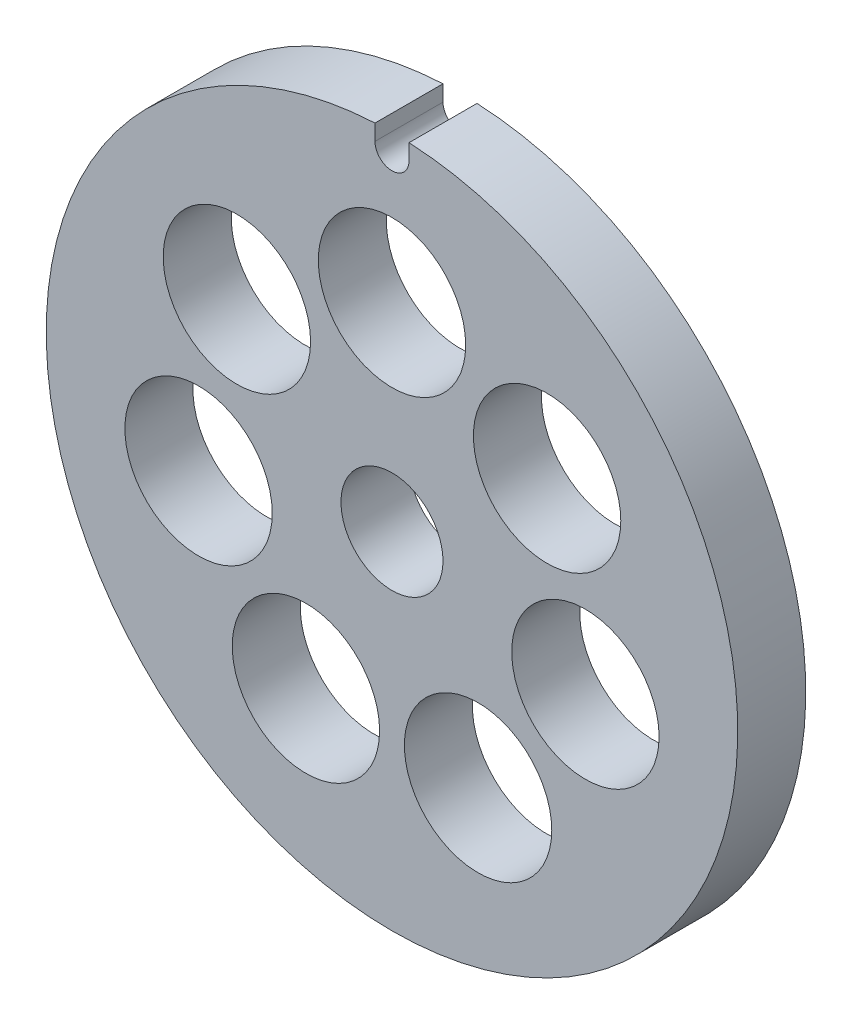
ISO-10303-21;
HEADER;
FILE_DESCRIPTION(('STEP AP214'),'2;1');
FILE_NAME('part.step','',(''),(''),'','','');
FILE_SCHEMA(('AUTOMOTIVE_DESIGN { 1 0 10303 214 1 1 1 1 }'));
ENDSEC;
DATA;
#1=APPLICATION_CONTEXT('core data for automotive mechanical design processes');
#2=APPLICATION_PROTOCOL_DEFINITION('international standard','automotive_design',2000,#1);
#3=PRODUCT_CONTEXT('',#1,'mechanical');
#4=PRODUCT('Part','Part','',(#3));
#5=PRODUCT_RELATED_PRODUCT_CATEGORY('part','',(#4));
#6=PRODUCT_DEFINITION_FORMATION('','',#4);
#7=PRODUCT_DEFINITION_CONTEXT('part definition',#1,'design');
#8=PRODUCT_DEFINITION('design','',#6,#7);
#9=PRODUCT_DEFINITION_SHAPE('','',#8);
#10=(LENGTH_UNIT() NAMED_UNIT(*) SI_UNIT(.MILLI.,.METRE.));
#11=(NAMED_UNIT(*) PLANE_ANGLE_UNIT() SI_UNIT($,.RADIAN.));
#12=(NAMED_UNIT(*) SI_UNIT($,.STERADIAN.) SOLID_ANGLE_UNIT());
#13=UNCERTAINTY_MEASURE_WITH_UNIT(LENGTH_MEASURE(1.E-05),#10,'distance_accuracy_value','');
#14=(GEOMETRIC_REPRESENTATION_CONTEXT(3) GLOBAL_UNCERTAINTY_ASSIGNED_CONTEXT((#13)) GLOBAL_UNIT_ASSIGNED_CONTEXT((#10,
#11,#12)) REPRESENTATION_CONTEXT('',''));
#15=CARTESIAN_POINT('',(0.,0.,0.));
#16=DIRECTION('',(0.,0.,1.));
#17=DIRECTION('',(1.,0.,0.));
#18=AXIS2_PLACEMENT_3D('',#15,#16,#17);
#19=CARTESIAN_POINT('',(0.,0.,6.));
#20=DIRECTION('',(0.,0.,1.));
#21=DIRECTION('',(1.,0.,0.));
#22=AXIS2_PLACEMENT_3D('',#19,#20,#21);
#23=PLANE('',#22);
#24=CARTESIAN_POINT('',(-17.0612384631819,-3.89411634423551,6.));
#25=DIRECTION('',(0.,0.,1.));
#26=DIRECTION('',(1.,0.,0.));
#27=AXIS2_PLACEMENT_3D('',#24,#25,#26);
#28=CIRCLE('',#27,6.50000000000016);
#29=CARTESIAN_POINT('',(-10.5612384631818,-3.89411634423551,6.));
#30=VERTEX_POINT('',#29);
#31=EDGE_CURVE('E178',#30,#30,#28,.T.);
#32=ORIENTED_EDGE('',*,*,#31,.F.);
#33=EDGE_LOOP('',(#32));
#34=FACE_BOUND('',#33,.T.);
#35=CARTESIAN_POINT('',(7.59296543455727,-15.7669551882923,6.));
#36=DIRECTION('',(0.,0.,1.));
#37=DIRECTION('',(1.,0.,0.));
#38=AXIS2_PLACEMENT_3D('',#35,#36,#37);
#39=CIRCLE('',#38,6.5000000000001);
#40=CARTESIAN_POINT('',(14.0929654345574,-15.7669551882923,6.));
#41=VERTEX_POINT('',#40);
#42=EDGE_CURVE('E162',#41,#41,#39,.T.);
#43=ORIENTED_EDGE('',*,*,#42,.F.);
#44=EDGE_LOOP('',(#43));
#45=FACE_BOUND('',#44,.T.);
#46=CARTESIAN_POINT('',(13.6820509431905,10.9110715325278,6.));
#47=DIRECTION('',(0.,0.,1.));
#48=DIRECTION('',(1.,0.,0.));
#49=AXIS2_PLACEMENT_3D('',#46,#47,#48);
#50=CIRCLE('',#49,6.5);
#51=CARTESIAN_POINT('',(20.1820509431905,10.9110715325278,6.));
#52=VERTEX_POINT('',#51);
#53=EDGE_CURVE('E146',#52,#52,#50,.T.);
#54=ORIENTED_EDGE('',*,*,#53,.F.);
#55=EDGE_LOOP('',(#54));
#56=FACE_BOUND('',#55,.T.);
#57=CARTESIAN_POINT('',(0.,0.,6.));
#58=DIRECTION('',(0.,0.,1.));
#59=DIRECTION('',(1.,0.,0.));
#60=AXIS2_PLACEMENT_3D('',#57,#58,#59);
#61=CIRCLE('',#60,4.5);
#62=CARTESIAN_POINT('',(4.5,0.,6.));
#63=VERTEX_POINT('',#62);
#64=EDGE_CURVE('E116',#63,#63,#61,.T.);
#65=ORIENTED_EDGE('',*,*,#64,.F.);
#66=EDGE_LOOP('',(#65));
#67=FACE_BOUND('',#66,.T.);
#68=CARTESIAN_POINT('',(0.,0.,6.));
#69=DIRECTION('',(0.,0.,1.));
#70=DIRECTION('',(1.,0.,0.));
#71=AXIS2_PLACEMENT_3D('',#68,#69,#70);
#72=CIRCLE('',#71,30.5);
#73=CARTESIAN_POINT('',(-1.5,30.4630924234556,6.));
#74=VERTEX_POINT('',#73);
#75=CARTESIAN_POINT('',(1.5,30.4630924234556,6.));
#76=VERTEX_POINT('',#75);
#77=EDGE_CURVE('E96',#74,#76,#72,.T.);
#78=ORIENTED_EDGE('',*,*,#77,.T.);
#79=DIRECTION('',(0.,-1.,0.));
#80=VECTOR('',#79,1.);
#81=CARTESIAN_POINT('',(1.5,29.0630924234556,6.));
#82=LINE('',#81,#80);
#83=CARTESIAN_POINT('',(1.5,29.0630924234556,6.));
#84=VERTEX_POINT('',#83);
#85=EDGE_CURVE('E91',#76,#84,#82,.T.);
#86=ORIENTED_EDGE('',*,*,#85,.T.);
#87=CARTESIAN_POINT('',(0.,29.0630924234556,6.));
#88=DIRECTION('',(0.,0.,-1.));
#89=DIRECTION('',(1.,0.,0.));
#90=AXIS2_PLACEMENT_3D('',#87,#88,#89);
#91=CIRCLE('',#90,1.5);
#92=CARTESIAN_POINT('',(-1.5,29.0630924234556,6.));
#93=VERTEX_POINT('',#92);
#94=EDGE_CURVE('E94',#84,#93,#91,.T.);
#95=ORIENTED_EDGE('',*,*,#94,.T.);
#96=DIRECTION('',(0.,1.,0.));
#97=VECTOR('',#96,1.);
#98=CARTESIAN_POINT('',(-1.5,30.4630924234556,6.));
#99=LINE('',#98,#97);
#100=EDGE_CURVE('E61',#93,#74,#99,.T.);
#101=ORIENTED_EDGE('',*,*,#100,.T.);
#102=EDGE_LOOP('',(#78,#86,#95,#101));
#103=FACE_BOUND('',#102,.T.);
#104=CARTESIAN_POINT('',(0.,17.5,6.));
#105=DIRECTION('',(0.,0.,1.));
#106=DIRECTION('',(1.,0.,0.));
#107=AXIS2_PLACEMENT_3D('',#104,#105,#106);
#108=CIRCLE('',#107,6.5);
#109=CARTESIAN_POINT('',(6.5,17.5,6.));
#110=VERTEX_POINT('',#109);
#111=EDGE_CURVE('E138',#110,#110,#108,.T.);
#112=ORIENTED_EDGE('',*,*,#111,.F.);
#113=EDGE_LOOP('',(#112));
#114=FACE_BOUND('',#113,.T.);
#115=CARTESIAN_POINT('',(17.0612384631819,-3.8941163442355,6.));
#116=DIRECTION('',(0.,0.,1.));
#117=DIRECTION('',(1.,0.,0.));
#118=AXIS2_PLACEMENT_3D('',#115,#116,#117);
#119=CIRCLE('',#118,6.50000000000007);
#120=CARTESIAN_POINT('',(23.561238463182,-3.8941163442355,6.));
#121=VERTEX_POINT('',#120);
#122=EDGE_CURVE('E154',#121,#121,#119,.T.);
#123=ORIENTED_EDGE('',*,*,#122,.F.);
#124=EDGE_LOOP('',(#123));
#125=FACE_BOUND('',#124,.T.);
#126=CARTESIAN_POINT('',(-7.59296543455727,-15.7669551882923,6.));
#127=DIRECTION('',(0.,0.,1.));
#128=DIRECTION('',(1.,0.,0.));
#129=AXIS2_PLACEMENT_3D('',#126,#127,#128);
#130=CIRCLE('',#129,6.50000000000013);
#131=CARTESIAN_POINT('',(-1.09296543455713,-15.7669551882923,6.));
#132=VERTEX_POINT('',#131);
#133=EDGE_CURVE('E170',#132,#132,#130,.T.);
#134=ORIENTED_EDGE('',*,*,#133,.F.);
#135=EDGE_LOOP('',(#134));
#136=FACE_BOUND('',#135,.T.);
#137=CARTESIAN_POINT('',(-13.6820509431902,10.9110715325273,6.));
#138=DIRECTION('',(0.,0.,1.));
#139=DIRECTION('',(1.,0.,0.));
#140=AXIS2_PLACEMENT_3D('',#137,#138,#139);
#141=CIRCLE('',#140,6.50000000000064);
#142=CARTESIAN_POINT('',(-7.1820509431896,10.9110715325273,6.));
#143=VERTEX_POINT('',#142);
#144=EDGE_CURVE('E186',#143,#143,#141,.T.);
#145=ORIENTED_EDGE('',*,*,#144,.F.);
#146=EDGE_LOOP('',(#145));
#147=FACE_BOUND('',#146,.T.);
#148=ADVANCED_FACE('F43',(#34,#45,#56,#67,#103,#114,#125,#136,#147),#23,.T.);
#149=CARTESIAN_POINT('',(0.,0.,0.));
#150=DIRECTION('',(0.,0.,1.));
#151=DIRECTION('',(1.,0.,0.));
#152=AXIS2_PLACEMENT_3D('',#149,#150,#151);
#153=PLANE('',#152);
#154=CARTESIAN_POINT('',(0.,0.,0.));
#155=DIRECTION('',(0.,0.,1.));
#156=DIRECTION('',(1.,0.,0.));
#157=AXIS2_PLACEMENT_3D('',#154,#155,#156);
#158=CIRCLE('',#157,30.5);
#159=CARTESIAN_POINT('',(-1.5,30.4630924234556,0.));
#160=VERTEX_POINT('',#159);
#161=CARTESIAN_POINT('',(1.5,30.4630924234556,0.));
#162=VERTEX_POINT('',#161);
#163=EDGE_CURVE('E112',#160,#162,#158,.T.);
#164=ORIENTED_EDGE('',*,*,#163,.F.);
#165=DIRECTION('',(0.,1.,0.));
#166=VECTOR('',#165,1.);
#167=CARTESIAN_POINT('',(-1.5,30.4630924234556,0.));
#168=LINE('',#167,#166);
#169=CARTESIAN_POINT('',(-1.5,29.0630924234556,0.));
#170=VERTEX_POINT('',#169);
#171=EDGE_CURVE('E84',#170,#160,#168,.T.);
#172=ORIENTED_EDGE('',*,*,#171,.F.);
#173=CARTESIAN_POINT('',(0.,29.0630924234556,0.));
#174=DIRECTION('',(0.,0.,-1.));
#175=DIRECTION('',(1.,0.,0.));
#176=AXIS2_PLACEMENT_3D('',#173,#174,#175);
#177=CIRCLE('',#176,1.5);
#178=CARTESIAN_POINT('',(1.5,29.0630924234556,0.));
#179=VERTEX_POINT('',#178);
#180=EDGE_CURVE('E78',#179,#170,#177,.T.);
#181=ORIENTED_EDGE('',*,*,#180,.F.);
#182=DIRECTION('',(0.,-1.,0.));
#183=VECTOR('',#182,1.);
#184=CARTESIAN_POINT('',(1.5,29.0630924234556,0.));
#185=LINE('',#184,#183);
#186=EDGE_CURVE('E101',#162,#179,#185,.T.);
#187=ORIENTED_EDGE('',*,*,#186,.F.);
#188=EDGE_LOOP('',(#164,#172,#181,#187));
#189=FACE_BOUND('',#188,.T.);
#190=CARTESIAN_POINT('',(0.,0.,0.));
#191=DIRECTION('',(0.,0.,1.));
#192=DIRECTION('',(1.,0.,0.));
#193=AXIS2_PLACEMENT_3D('',#190,#191,#192);
#194=CIRCLE('',#193,4.5);
#195=CARTESIAN_POINT('',(4.5,0.,0.));
#196=VERTEX_POINT('',#195);
#197=EDGE_CURVE('E134',#196,#196,#194,.T.);
#198=ORIENTED_EDGE('',*,*,#197,.T.);
#199=EDGE_LOOP('',(#198));
#200=FACE_BOUND('',#199,.T.);
#201=CARTESIAN_POINT('',(0.,17.5,0.));
#202=DIRECTION('',(0.,0.,1.));
#203=DIRECTION('',(1.,0.,0.));
#204=AXIS2_PLACEMENT_3D('',#201,#202,#203);
#205=CIRCLE('',#204,6.5);
#206=CARTESIAN_POINT('',(6.5,17.5,0.));
#207=VERTEX_POINT('',#206);
#208=EDGE_CURVE('E142',#207,#207,#205,.T.);
#209=ORIENTED_EDGE('',*,*,#208,.T.);
#210=EDGE_LOOP('',(#209));
#211=FACE_BOUND('',#210,.T.);
#212=CARTESIAN_POINT('',(13.6820509431905,10.9110715325278,0.));
#213=DIRECTION('',(0.,0.,1.));
#214=DIRECTION('',(1.,0.,0.));
#215=AXIS2_PLACEMENT_3D('',#212,#213,#214);
#216=CIRCLE('',#215,6.5);
#217=CARTESIAN_POINT('',(20.1820509431905,10.9110715325278,0.));
#218=VERTEX_POINT('',#217);
#219=EDGE_CURVE('E150',#218,#218,#216,.T.);
#220=ORIENTED_EDGE('',*,*,#219,.T.);
#221=EDGE_LOOP('',(#220));
#222=FACE_BOUND('',#221,.T.);
#223=CARTESIAN_POINT('',(17.0612384631819,-3.8941163442355,0.));
#224=DIRECTION('',(0.,0.,1.));
#225=DIRECTION('',(1.,0.,0.));
#226=AXIS2_PLACEMENT_3D('',#223,#224,#225);
#227=CIRCLE('',#226,6.50000000000007);
#228=CARTESIAN_POINT('',(23.561238463182,-3.8941163442355,0.));
#229=VERTEX_POINT('',#228);
#230=EDGE_CURVE('E158',#229,#229,#227,.T.);
#231=ORIENTED_EDGE('',*,*,#230,.T.);
#232=EDGE_LOOP('',(#231));
#233=FACE_BOUND('',#232,.T.);
#234=CARTESIAN_POINT('',(7.59296543455727,-15.7669551882923,0.));
#235=DIRECTION('',(0.,0.,1.));
#236=DIRECTION('',(1.,0.,0.));
#237=AXIS2_PLACEMENT_3D('',#234,#235,#236);
#238=CIRCLE('',#237,6.5000000000001);
#239=CARTESIAN_POINT('',(14.0929654345574,-15.7669551882923,0.));
#240=VERTEX_POINT('',#239);
#241=EDGE_CURVE('E166',#240,#240,#238,.T.);
#242=ORIENTED_EDGE('',*,*,#241,.T.);
#243=EDGE_LOOP('',(#242));
#244=FACE_BOUND('',#243,.T.);
#245=CARTESIAN_POINT('',(-7.59296543455727,-15.7669551882923,0.));
#246=DIRECTION('',(0.,0.,1.));
#247=DIRECTION('',(1.,0.,0.));
#248=AXIS2_PLACEMENT_3D('',#245,#246,#247);
#249=CIRCLE('',#248,6.50000000000013);
#250=CARTESIAN_POINT('',(-1.09296543455713,-15.7669551882923,0.));
#251=VERTEX_POINT('',#250);
#252=EDGE_CURVE('E174',#251,#251,#249,.T.);
#253=ORIENTED_EDGE('',*,*,#252,.T.);
#254=EDGE_LOOP('',(#253));
#255=FACE_BOUND('',#254,.T.);
#256=CARTESIAN_POINT('',(-17.0612384631819,-3.89411634423551,0.));
#257=DIRECTION('',(0.,0.,1.));
#258=DIRECTION('',(1.,0.,0.));
#259=AXIS2_PLACEMENT_3D('',#256,#257,#258);
#260=CIRCLE('',#259,6.50000000000016);
#261=CARTESIAN_POINT('',(-10.5612384631818,-3.89411634423551,0.));
#262=VERTEX_POINT('',#261);
#263=EDGE_CURVE('E182',#262,#262,#260,.T.);
#264=ORIENTED_EDGE('',*,*,#263,.T.);
#265=EDGE_LOOP('',(#264));
#266=FACE_BOUND('',#265,.T.);
#267=CARTESIAN_POINT('',(-13.6820509431902,10.9110715325273,0.));
#268=DIRECTION('',(0.,0.,1.));
#269=DIRECTION('',(1.,0.,0.));
#270=AXIS2_PLACEMENT_3D('',#267,#268,#269);
#271=CIRCLE('',#270,6.50000000000064);
#272=CARTESIAN_POINT('',(-7.1820509431896,10.9110715325273,0.));
#273=VERTEX_POINT('',#272);
#274=EDGE_CURVE('E190',#273,#273,#271,.T.);
#275=ORIENTED_EDGE('',*,*,#274,.T.);
#276=EDGE_LOOP('',(#275));
#277=FACE_BOUND('',#276,.T.);
#278=ADVANCED_FACE('F129',(#189,#200,#211,#222,#233,#244,#255,#266,#277),#153,.F.);
#279=CARTESIAN_POINT('',(0.,0.,6.));
#280=DIRECTION('',(0.,0.,-1.));
#281=DIRECTION('',(-1.,0.,0.));
#282=AXIS2_PLACEMENT_3D('',#279,#280,#281);
#283=CYLINDRICAL_SURFACE('',#282,30.5);
#284=ORIENTED_EDGE('',*,*,#163,.T.);
#285=DIRECTION('',(0.,0.,-1.));
#286=VECTOR('',#285,1.);
#287=CARTESIAN_POINT('',(1.5,30.4630924234556,6.));
#288=LINE('',#287,#286);
#289=EDGE_CURVE('E11',#76,#162,#288,.T.);
#290=ORIENTED_EDGE('',*,*,#289,.F.);
#291=ORIENTED_EDGE('',*,*,#77,.F.);
#292=DIRECTION('',(0.,0.,-1.));
#293=VECTOR('',#292,1.);
#294=CARTESIAN_POINT('',(-1.5,30.4630924234556,6.));
#295=LINE('',#294,#293);
#296=EDGE_CURVE('E108',#74,#160,#295,.T.);
#297=ORIENTED_EDGE('',*,*,#296,.T.);
#298=EDGE_LOOP('',(#284,#290,#291,#297));
#299=FACE_BOUND('',#298,.T.);
#300=ADVANCED_FACE('F45',(#299),#283,.T.);
#301=CARTESIAN_POINT('',(1.5,29.0630924234556,6.));
#302=DIRECTION('',(1.,0.,0.));
#303=DIRECTION('',(0.,0.,-1.));
#304=AXIS2_PLACEMENT_3D('',#301,#302,#303);
#305=PLANE('',#304);
#306=ORIENTED_EDGE('',*,*,#186,.T.);
#307=DIRECTION('',(0.,0.,-1.));
#308=VECTOR('',#307,1.);
#309=CARTESIAN_POINT('',(1.5,29.0630924234556,6.));
#310=LINE('',#309,#308);
#311=EDGE_CURVE('E53',#84,#179,#310,.T.);
#312=ORIENTED_EDGE('',*,*,#311,.F.);
#313=ORIENTED_EDGE('',*,*,#85,.F.);
#314=ORIENTED_EDGE('',*,*,#289,.T.);
#315=EDGE_LOOP('',(#306,#312,#313,#314));
#316=FACE_BOUND('',#315,.T.);
#317=ADVANCED_FACE('F100',(#316),#305,.F.);
#318=CARTESIAN_POINT('',(0.,29.0630924234556,6.));
#319=DIRECTION('',(0.,0.,-1.));
#320=DIRECTION('',(-1.,0.,0.));
#321=AXIS2_PLACEMENT_3D('',#318,#319,#320);
#322=CYLINDRICAL_SURFACE('',#321,1.5);
#323=ORIENTED_EDGE('',*,*,#180,.T.);
#324=DIRECTION('',(0.,0.,-1.));
#325=VECTOR('',#324,1.);
#326=CARTESIAN_POINT('',(-1.5,29.0630924234556,6.));
#327=LINE('',#326,#325);
#328=EDGE_CURVE('E103',#93,#170,#327,.T.);
#329=ORIENTED_EDGE('',*,*,#328,.F.);
#330=ORIENTED_EDGE('',*,*,#94,.F.);
#331=ORIENTED_EDGE('',*,*,#311,.T.);
#332=EDGE_LOOP('',(#323,#329,#330,#331));
#333=FACE_BOUND('',#332,.T.);
#334=ADVANCED_FACE('F104',(#333),#322,.F.);
#335=CARTESIAN_POINT('',(-1.5,30.4630924234556,6.));
#336=DIRECTION('',(-1.,0.,0.));
#337=DIRECTION('',(0.,-1.,0.));
#338=AXIS2_PLACEMENT_3D('',#335,#336,#337);
#339=PLANE('',#338);
#340=ORIENTED_EDGE('',*,*,#171,.T.);
#341=ORIENTED_EDGE('',*,*,#296,.F.);
#342=ORIENTED_EDGE('',*,*,#100,.F.);
#343=ORIENTED_EDGE('',*,*,#328,.T.);
#344=EDGE_LOOP('',(#340,#341,#342,#343));
#345=FACE_BOUND('',#344,.T.);
#346=ADVANCED_FACE('F126',(#345),#339,.F.);
#347=CARTESIAN_POINT('',(0.,0.,6.));
#348=DIRECTION('',(0.,0.,-1.));
#349=DIRECTION('',(-1.,0.,0.));
#350=AXIS2_PLACEMENT_3D('',#347,#348,#349);
#351=CYLINDRICAL_SURFACE('',#350,4.5);
#352=ORIENTED_EDGE('',*,*,#64,.T.);
#353=EDGE_LOOP('',(#352));
#354=FACE_BOUND('',#353,.T.);
#355=ORIENTED_EDGE('',*,*,#197,.F.);
#356=EDGE_LOOP('',(#355));
#357=FACE_BOUND('',#356,.T.);
#358=ADVANCED_FACE('F211',(#354,#357),#351,.F.);
#359=CARTESIAN_POINT('',(0.,17.5,6.));
#360=DIRECTION('',(0.,0.,-1.));
#361=DIRECTION('',(-1.,0.,0.));
#362=AXIS2_PLACEMENT_3D('',#359,#360,#361);
#363=CYLINDRICAL_SURFACE('',#362,6.5);
#364=ORIENTED_EDGE('',*,*,#111,.T.);
#365=EDGE_LOOP('',(#364));
#366=FACE_BOUND('',#365,.T.);
#367=ORIENTED_EDGE('',*,*,#208,.F.);
#368=EDGE_LOOP('',(#367));
#369=FACE_BOUND('',#368,.T.);
#370=ADVANCED_FACE('F265',(#366,#369),#363,.F.);
#371=CARTESIAN_POINT('',(13.6820509431905,10.9110715325278,6.));
#372=DIRECTION('',(0.,0.,-1.));
#373=DIRECTION('',(-1.,0.,0.));
#374=AXIS2_PLACEMENT_3D('',#371,#372,#373);
#375=CYLINDRICAL_SURFACE('',#374,6.5);
#376=ORIENTED_EDGE('',*,*,#53,.T.);
#377=EDGE_LOOP('',(#376));
#378=FACE_BOUND('',#377,.T.);
#379=ORIENTED_EDGE('',*,*,#219,.F.);
#380=EDGE_LOOP('',(#379));
#381=FACE_BOUND('',#380,.T.);
#382=ADVANCED_FACE('F274',(#378,#381),#375,.F.);
#383=CARTESIAN_POINT('',(17.0612384631819,-3.8941163442355,6.));
#384=DIRECTION('',(0.,0.,-1.));
#385=DIRECTION('',(-1.,0.,0.));
#386=AXIS2_PLACEMENT_3D('',#383,#384,#385);
#387=CYLINDRICAL_SURFACE('',#386,6.50000000000007);
#388=ORIENTED_EDGE('',*,*,#122,.T.);
#389=EDGE_LOOP('',(#388));
#390=FACE_BOUND('',#389,.T.);
#391=ORIENTED_EDGE('',*,*,#230,.F.);
#392=EDGE_LOOP('',(#391));
#393=FACE_BOUND('',#392,.T.);
#394=ADVANCED_FACE('F283',(#390,#393),#387,.F.);
#395=CARTESIAN_POINT('',(7.59296543455727,-15.7669551882923,6.));
#396=DIRECTION('',(0.,0.,-1.));
#397=DIRECTION('',(-1.,0.,0.));
#398=AXIS2_PLACEMENT_3D('',#395,#396,#397);
#399=CYLINDRICAL_SURFACE('',#398,6.5000000000001);
#400=ORIENTED_EDGE('',*,*,#42,.T.);
#401=EDGE_LOOP('',(#400));
#402=FACE_BOUND('',#401,.T.);
#403=ORIENTED_EDGE('',*,*,#241,.F.);
#404=EDGE_LOOP('',(#403));
#405=FACE_BOUND('',#404,.T.);
#406=ADVANCED_FACE('F293',(#402,#405),#399,.F.);
#407=CARTESIAN_POINT('',(-7.59296543455727,-15.7669551882923,6.));
#408=DIRECTION('',(0.,0.,-1.));
#409=DIRECTION('',(-1.,0.,0.));
#410=AXIS2_PLACEMENT_3D('',#407,#408,#409);
#411=CYLINDRICAL_SURFACE('',#410,6.50000000000013);
#412=ORIENTED_EDGE('',*,*,#133,.T.);
#413=EDGE_LOOP('',(#412));
#414=FACE_BOUND('',#413,.T.);
#415=ORIENTED_EDGE('',*,*,#252,.F.);
#416=EDGE_LOOP('',(#415));
#417=FACE_BOUND('',#416,.T.);
#418=ADVANCED_FACE('F303',(#414,#417),#411,.F.);
#419=CARTESIAN_POINT('',(-17.0612384631819,-3.89411634423551,6.));
#420=DIRECTION('',(0.,0.,-1.));
#421=DIRECTION('',(-1.,0.,0.));
#422=AXIS2_PLACEMENT_3D('',#419,#420,#421);
#423=CYLINDRICAL_SURFACE('',#422,6.50000000000016);
#424=ORIENTED_EDGE('',*,*,#31,.T.);
#425=EDGE_LOOP('',(#424));
#426=FACE_BOUND('',#425,.T.);
#427=ORIENTED_EDGE('',*,*,#263,.F.);
#428=EDGE_LOOP('',(#427));
#429=FACE_BOUND('',#428,.T.);
#430=ADVANCED_FACE('F313',(#426,#429),#423,.F.);
#431=CARTESIAN_POINT('',(-13.6820509431902,10.9110715325273,6.));
#432=DIRECTION('',(0.,0.,-1.));
#433=DIRECTION('',(-1.,0.,0.));
#434=AXIS2_PLACEMENT_3D('',#431,#432,#433);
#435=CYLINDRICAL_SURFACE('',#434,6.50000000000064);
#436=ORIENTED_EDGE('',*,*,#144,.T.);
#437=EDGE_LOOP('',(#436));
#438=FACE_BOUND('',#437,.T.);
#439=ORIENTED_EDGE('',*,*,#274,.F.);
#440=EDGE_LOOP('',(#439));
#441=FACE_BOUND('',#440,.T.);
#442=ADVANCED_FACE('F198',(#438,#441),#435,.F.);
#443=CLOSED_SHELL('',(#148,#278,#300,#317,#334,#346,#358,#370,#382,#394,#406,#418,#430,#442));
#444=MANIFOLD_SOLID_BREP('B2',#443);
#445=ADVANCED_BREP_SHAPE_REPRESENTATION('',(#18,#444),#14);
#446=SHAPE_DEFINITION_REPRESENTATION(#9,#445);
ENDSEC;
END-ISO-10303-21;
